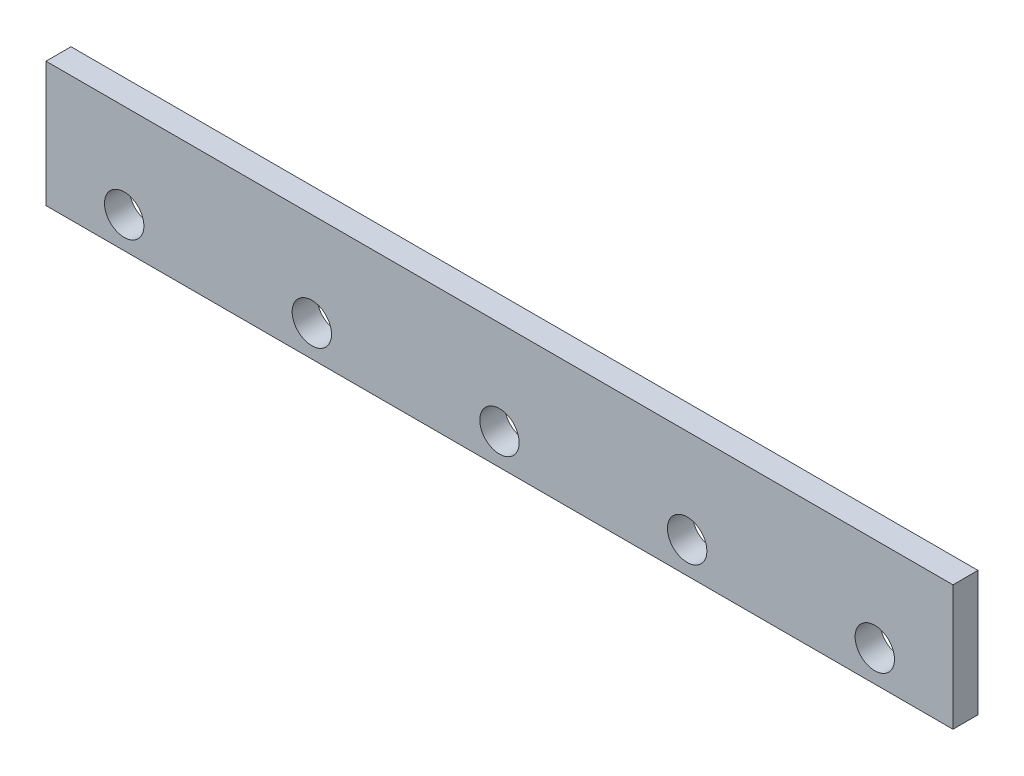
ISO-10303-21;
HEADER;
FILE_DESCRIPTION(('STEP AP214'),'2;1');
FILE_NAME('part.step','',(''),(''),'','','');
FILE_SCHEMA(('AUTOMOTIVE_DESIGN { 1 0 10303 214 1 1 1 1 }'));
ENDSEC;
DATA;
#1=APPLICATION_CONTEXT('core data for automotive mechanical design processes');
#2=APPLICATION_PROTOCOL_DEFINITION('international standard','automotive_design',2000,#1);
#3=PRODUCT_CONTEXT('',#1,'mechanical');
#4=PRODUCT('Part','Part','',(#3));
#5=PRODUCT_RELATED_PRODUCT_CATEGORY('part','',(#4));
#6=PRODUCT_DEFINITION_FORMATION('','',#4);
#7=PRODUCT_DEFINITION_CONTEXT('part definition',#1,'design');
#8=PRODUCT_DEFINITION('design','',#6,#7);
#9=PRODUCT_DEFINITION_SHAPE('','',#8);
#10=(LENGTH_UNIT() NAMED_UNIT(*) SI_UNIT(.MILLI.,.METRE.));
#11=(NAMED_UNIT(*) PLANE_ANGLE_UNIT() SI_UNIT($,.RADIAN.));
#12=(NAMED_UNIT(*) SI_UNIT($,.STERADIAN.) SOLID_ANGLE_UNIT());
#13=UNCERTAINTY_MEASURE_WITH_UNIT(LENGTH_MEASURE(1.E-05),#10,'distance_accuracy_value','');
#14=(GEOMETRIC_REPRESENTATION_CONTEXT(3) GLOBAL_UNCERTAINTY_ASSIGNED_CONTEXT((#13)) GLOBAL_UNIT_ASSIGNED_CONTEXT((#10,
#11,#12)) REPRESENTATION_CONTEXT('',''));
#15=CARTESIAN_POINT('',(0.,0.,0.));
#16=DIRECTION('',(0.,0.,1.));
#17=DIRECTION('',(1.,0.,0.));
#18=AXIS2_PLACEMENT_3D('',#15,#16,#17);
#19=CARTESIAN_POINT('',(0.,0.,16.));
#20=DIRECTION('',(0.,0.,-1.));
#21=DIRECTION('',(-1.,0.,0.));
#22=AXIS2_PLACEMENT_3D('',#19,#20,#21);
#23=PLANE('',#22);
#24=DIRECTION('',(0.,-1.,0.));
#25=VECTOR('',#24,1.);
#26=CARTESIAN_POINT('',(0.,0.,16.));
#27=LINE('',#26,#25);
#28=CARTESIAN_POINT('',(0.,80.,16.));
#29=VERTEX_POINT('',#28);
#30=CARTESIAN_POINT('',(0.,0.,16.));
#31=VERTEX_POINT('',#30);
#32=EDGE_CURVE('E85',#29,#31,#27,.T.);
#33=ORIENTED_EDGE('',*,*,#32,.T.);
#34=DIRECTION('',(1.,0.,0.));
#35=VECTOR('',#34,1.);
#36=CARTESIAN_POINT('',(0.,0.,16.));
#37=LINE('',#36,#35);
#38=CARTESIAN_POINT('',(580.,0.,16.));
#39=VERTEX_POINT('',#38);
#40=EDGE_CURVE('E80',#31,#39,#37,.T.);
#41=ORIENTED_EDGE('',*,*,#40,.T.);
#42=DIRECTION('',(0.,1.,0.));
#43=VECTOR('',#42,1.);
#44=CARTESIAN_POINT('',(580.,0.,16.));
#45=LINE('',#44,#43);
#46=CARTESIAN_POINT('',(580.,80.,16.));
#47=VERTEX_POINT('',#46);
#48=EDGE_CURVE('E83',#39,#47,#45,.T.);
#49=ORIENTED_EDGE('',*,*,#48,.T.);
#50=DIRECTION('',(-1.,0.,0.));
#51=VECTOR('',#50,1.);
#52=CARTESIAN_POINT('',(0.,80.,16.));
#53=LINE('',#52,#51);
#54=EDGE_CURVE('E50',#47,#29,#53,.T.);
#55=ORIENTED_EDGE('',*,*,#54,.T.);
#56=EDGE_LOOP('',(#33,#41,#49,#55));
#57=FACE_BOUND('',#56,.T.);
#58=CARTESIAN_POINT('',(50.,20.,16.));
#59=DIRECTION('',(0.,0.,1.));
#60=DIRECTION('',(1.,0.,0.));
#61=AXIS2_PLACEMENT_3D('',#58,#59,#60);
#62=CIRCLE('',#61,12.6);
#63=CARTESIAN_POINT('',(62.6,20.,16.));
#64=VERTEX_POINT('',#63);
#65=EDGE_CURVE('E100',#64,#64,#62,.T.);
#66=ORIENTED_EDGE('',*,*,#65,.F.);
#67=EDGE_LOOP('',(#66));
#68=FACE_BOUND('',#67,.T.);
#69=CARTESIAN_POINT('',(170.,20.,16.));
#70=DIRECTION('',(0.,0.,1.));
#71=DIRECTION('',(1.,0.,0.));
#72=AXIS2_PLACEMENT_3D('',#69,#70,#71);
#73=CIRCLE('',#72,12.6);
#74=CARTESIAN_POINT('',(182.6,20.,16.));
#75=VERTEX_POINT('',#74);
#76=EDGE_CURVE('E115',#75,#75,#73,.T.);
#77=ORIENTED_EDGE('',*,*,#76,.F.);
#78=EDGE_LOOP('',(#77));
#79=FACE_BOUND('',#78,.T.);
#80=CARTESIAN_POINT('',(290.,20.,16.));
#81=DIRECTION('',(0.,0.,1.));
#82=DIRECTION('',(1.,0.,0.));
#83=AXIS2_PLACEMENT_3D('',#80,#81,#82);
#84=CIRCLE('',#83,12.6);
#85=CARTESIAN_POINT('',(302.6,20.,16.));
#86=VERTEX_POINT('',#85);
#87=EDGE_CURVE('E121',#86,#86,#84,.T.);
#88=ORIENTED_EDGE('',*,*,#87,.F.);
#89=EDGE_LOOP('',(#88));
#90=FACE_BOUND('',#89,.T.);
#91=CARTESIAN_POINT('',(410.,20.,16.));
#92=DIRECTION('',(0.,0.,1.));
#93=DIRECTION('',(1.,0.,0.));
#94=AXIS2_PLACEMENT_3D('',#91,#92,#93);
#95=CIRCLE('',#94,12.6);
#96=CARTESIAN_POINT('',(422.6,20.,16.));
#97=VERTEX_POINT('',#96);
#98=EDGE_CURVE('E127',#97,#97,#95,.T.);
#99=ORIENTED_EDGE('',*,*,#98,.F.);
#100=EDGE_LOOP('',(#99));
#101=FACE_BOUND('',#100,.T.);
#102=CARTESIAN_POINT('',(530.,20.,16.));
#103=DIRECTION('',(0.,0.,1.));
#104=DIRECTION('',(1.,0.,0.));
#105=AXIS2_PLACEMENT_3D('',#102,#103,#104);
#106=CIRCLE('',#105,12.5999999999999);
#107=CARTESIAN_POINT('',(542.6,20.,16.));
#108=VERTEX_POINT('',#107);
#109=EDGE_CURVE('E133',#108,#108,#106,.T.);
#110=ORIENTED_EDGE('',*,*,#109,.F.);
#111=EDGE_LOOP('',(#110));
#112=FACE_BOUND('',#111,.T.);
#113=ADVANCED_FACE('F33',(#57,#68,#79,#90,#101,#112),#23,.F.);
#114=CARTESIAN_POINT('',(0.,0.,0.));
#115=DIRECTION('',(0.,0.,-1.));
#116=DIRECTION('',(-1.,0.,0.));
#117=AXIS2_PLACEMENT_3D('',#114,#115,#116);
#118=PLANE('',#117);
#119=CARTESIAN_POINT('',(410.,20.,0.));
#120=DIRECTION('',(0.,0.,1.));
#121=DIRECTION('',(1.,0.,0.));
#122=AXIS2_PLACEMENT_3D('',#119,#120,#121);
#123=CIRCLE('',#122,12.6);
#124=CARTESIAN_POINT('',(422.6,20.,0.));
#125=VERTEX_POINT('',#124);
#126=EDGE_CURVE('E130',#125,#125,#123,.T.);
#127=ORIENTED_EDGE('',*,*,#126,.T.);
#128=EDGE_LOOP('',(#127));
#129=FACE_BOUND('',#128,.T.);
#130=CARTESIAN_POINT('',(170.,20.,0.));
#131=DIRECTION('',(0.,0.,1.));
#132=DIRECTION('',(1.,0.,0.));
#133=AXIS2_PLACEMENT_3D('',#130,#131,#132);
#134=CIRCLE('',#133,12.6);
#135=CARTESIAN_POINT('',(182.6,20.,0.));
#136=VERTEX_POINT('',#135);
#137=EDGE_CURVE('E118',#136,#136,#134,.T.);
#138=ORIENTED_EDGE('',*,*,#137,.T.);
#139=EDGE_LOOP('',(#138));
#140=FACE_BOUND('',#139,.T.);
#141=DIRECTION('',(0.,-1.,0.));
#142=VECTOR('',#141,1.);
#143=CARTESIAN_POINT('',(0.,0.,0.));
#144=LINE('',#143,#142);
#145=CARTESIAN_POINT('',(0.,80.,0.));
#146=VERTEX_POINT('',#145);
#147=CARTESIAN_POINT('',(0.,0.,0.));
#148=VERTEX_POINT('',#147);
#149=EDGE_CURVE('E97',#146,#148,#144,.T.);
#150=ORIENTED_EDGE('',*,*,#149,.F.);
#151=DIRECTION('',(-1.,0.,0.));
#152=VECTOR('',#151,1.);
#153=CARTESIAN_POINT('',(0.,80.,0.));
#154=LINE('',#153,#152);
#155=CARTESIAN_POINT('',(580.,80.,0.));
#156=VERTEX_POINT('',#155);
#157=EDGE_CURVE('E73',#156,#146,#154,.T.);
#158=ORIENTED_EDGE('',*,*,#157,.F.);
#159=DIRECTION('',(0.,1.,0.));
#160=VECTOR('',#159,1.);
#161=CARTESIAN_POINT('',(580.,0.,0.));
#162=LINE('',#161,#160);
#163=CARTESIAN_POINT('',(580.,0.,0.));
#164=VERTEX_POINT('',#163);
#165=EDGE_CURVE('E67',#164,#156,#162,.T.);
#166=ORIENTED_EDGE('',*,*,#165,.F.);
#167=DIRECTION('',(1.,0.,0.));
#168=VECTOR('',#167,1.);
#169=CARTESIAN_POINT('',(0.,0.,0.));
#170=LINE('',#169,#168);
#171=EDGE_CURVE('E89',#148,#164,#170,.T.);
#172=ORIENTED_EDGE('',*,*,#171,.F.);
#173=EDGE_LOOP('',(#150,#158,#166,#172));
#174=FACE_BOUND('',#173,.T.);
#175=CARTESIAN_POINT('',(50.,20.,0.));
#176=DIRECTION('',(0.,0.,1.));
#177=DIRECTION('',(1.,0.,0.));
#178=AXIS2_PLACEMENT_3D('',#175,#176,#177);
#179=CIRCLE('',#178,12.6);
#180=CARTESIAN_POINT('',(62.6,20.,0.));
#181=VERTEX_POINT('',#180);
#182=EDGE_CURVE('E112',#181,#181,#179,.T.);
#183=ORIENTED_EDGE('',*,*,#182,.T.);
#184=EDGE_LOOP('',(#183));
#185=FACE_BOUND('',#184,.T.);
#186=CARTESIAN_POINT('',(290.,20.,0.));
#187=DIRECTION('',(0.,0.,1.));
#188=DIRECTION('',(1.,0.,0.));
#189=AXIS2_PLACEMENT_3D('',#186,#187,#188);
#190=CIRCLE('',#189,12.6);
#191=CARTESIAN_POINT('',(302.6,20.,0.));
#192=VERTEX_POINT('',#191);
#193=EDGE_CURVE('E124',#192,#192,#190,.T.);
#194=ORIENTED_EDGE('',*,*,#193,.T.);
#195=EDGE_LOOP('',(#194));
#196=FACE_BOUND('',#195,.T.);
#197=CARTESIAN_POINT('',(530.,20.,0.));
#198=DIRECTION('',(0.,0.,1.));
#199=DIRECTION('',(1.,0.,0.));
#200=AXIS2_PLACEMENT_3D('',#197,#198,#199);
#201=CIRCLE('',#200,12.5999999999999);
#202=CARTESIAN_POINT('',(542.6,20.,0.));
#203=VERTEX_POINT('',#202);
#204=EDGE_CURVE('E136',#203,#203,#201,.T.);
#205=ORIENTED_EDGE('',*,*,#204,.T.);
#206=EDGE_LOOP('',(#205));
#207=FACE_BOUND('',#206,.T.);
#208=ADVANCED_FACE('F108',(#129,#140,#174,#185,#196,#207),#118,.T.);
#209=CARTESIAN_POINT('',(0.,0.,16.));
#210=DIRECTION('',(1.,0.,0.));
#211=DIRECTION('',(0.,0.,-1.));
#212=AXIS2_PLACEMENT_3D('',#209,#210,#211);
#213=PLANE('',#212);
#214=ORIENTED_EDGE('',*,*,#149,.T.);
#215=DIRECTION('',(0.,0.,-1.));
#216=VECTOR('',#215,1.);
#217=CARTESIAN_POINT('',(0.,0.,16.));
#218=LINE('',#217,#216);
#219=EDGE_CURVE('E11',#31,#148,#218,.T.);
#220=ORIENTED_EDGE('',*,*,#219,.F.);
#221=ORIENTED_EDGE('',*,*,#32,.F.);
#222=DIRECTION('',(0.,0.,-1.));
#223=VECTOR('',#222,1.);
#224=CARTESIAN_POINT('',(0.,80.,16.));
#225=LINE('',#224,#223);
#226=EDGE_CURVE('E93',#29,#146,#225,.T.);
#227=ORIENTED_EDGE('',*,*,#226,.T.);
#228=EDGE_LOOP('',(#214,#220,#221,#227));
#229=FACE_BOUND('',#228,.T.);
#230=ADVANCED_FACE('F35',(#229),#213,.F.);
#231=CARTESIAN_POINT('',(0.,0.,16.));
#232=DIRECTION('',(0.,1.,0.));
#233=DIRECTION('',(0.,0.,1.));
#234=AXIS2_PLACEMENT_3D('',#231,#232,#233);
#235=PLANE('',#234);
#236=ORIENTED_EDGE('',*,*,#171,.T.);
#237=DIRECTION('',(0.,0.,-1.));
#238=VECTOR('',#237,1.);
#239=CARTESIAN_POINT('',(580.,0.,16.));
#240=LINE('',#239,#238);
#241=EDGE_CURVE('E42',#39,#164,#240,.T.);
#242=ORIENTED_EDGE('',*,*,#241,.F.);
#243=ORIENTED_EDGE('',*,*,#40,.F.);
#244=ORIENTED_EDGE('',*,*,#219,.T.);
#245=EDGE_LOOP('',(#236,#242,#243,#244));
#246=FACE_BOUND('',#245,.T.);
#247=ADVANCED_FACE('F88',(#246),#235,.F.);
#248=CARTESIAN_POINT('',(580.,0.,16.));
#249=DIRECTION('',(-1.,0.,0.));
#250=DIRECTION('',(0.,0.,1.));
#251=AXIS2_PLACEMENT_3D('',#248,#249,#250);
#252=PLANE('',#251);
#253=ORIENTED_EDGE('',*,*,#165,.T.);
#254=DIRECTION('',(0.,0.,-1.));
#255=VECTOR('',#254,1.);
#256=CARTESIAN_POINT('',(580.,80.,16.));
#257=LINE('',#256,#255);
#258=EDGE_CURVE('E90',#47,#156,#257,.T.);
#259=ORIENTED_EDGE('',*,*,#258,.F.);
#260=ORIENTED_EDGE('',*,*,#48,.F.);
#261=ORIENTED_EDGE('',*,*,#241,.T.);
#262=EDGE_LOOP('',(#253,#259,#260,#261));
#263=FACE_BOUND('',#262,.T.);
#264=ADVANCED_FACE('F91',(#263),#252,.F.);
#265=CARTESIAN_POINT('',(0.,80.,16.));
#266=DIRECTION('',(0.,-1.,0.));
#267=DIRECTION('',(0.,0.,-1.));
#268=AXIS2_PLACEMENT_3D('',#265,#266,#267);
#269=PLANE('',#268);
#270=ORIENTED_EDGE('',*,*,#157,.T.);
#271=ORIENTED_EDGE('',*,*,#226,.F.);
#272=ORIENTED_EDGE('',*,*,#54,.F.);
#273=ORIENTED_EDGE('',*,*,#258,.T.);
#274=EDGE_LOOP('',(#270,#271,#272,#273));
#275=FACE_BOUND('',#274,.T.);
#276=ADVANCED_FACE('F105',(#275),#269,.F.);
#277=CARTESIAN_POINT('',(50.,20.,16.));
#278=DIRECTION('',(0.,0.,-1.));
#279=DIRECTION('',(-1.,0.,0.));
#280=AXIS2_PLACEMENT_3D('',#277,#278,#279);
#281=CYLINDRICAL_SURFACE('',#280,12.6);
#282=ORIENTED_EDGE('',*,*,#65,.T.);
#283=EDGE_LOOP('',(#282));
#284=FACE_BOUND('',#283,.T.);
#285=ORIENTED_EDGE('',*,*,#182,.F.);
#286=EDGE_LOOP('',(#285));
#287=FACE_BOUND('',#286,.T.);
#288=ADVANCED_FACE('F153',(#284,#287),#281,.F.);
#289=CARTESIAN_POINT('',(170.,20.,16.));
#290=DIRECTION('',(0.,0.,-1.));
#291=DIRECTION('',(-1.,0.,0.));
#292=AXIS2_PLACEMENT_3D('',#289,#290,#291);
#293=CYLINDRICAL_SURFACE('',#292,12.6);
#294=ORIENTED_EDGE('',*,*,#76,.T.);
#295=EDGE_LOOP('',(#294));
#296=FACE_BOUND('',#295,.T.);
#297=ORIENTED_EDGE('',*,*,#137,.F.);
#298=EDGE_LOOP('',(#297));
#299=FACE_BOUND('',#298,.T.);
#300=ADVANCED_FACE('F199',(#296,#299),#293,.F.);
#301=CARTESIAN_POINT('',(290.,20.,16.));
#302=DIRECTION('',(0.,0.,-1.));
#303=DIRECTION('',(-1.,0.,0.));
#304=AXIS2_PLACEMENT_3D('',#301,#302,#303);
#305=CYLINDRICAL_SURFACE('',#304,12.6);
#306=ORIENTED_EDGE('',*,*,#87,.T.);
#307=EDGE_LOOP('',(#306));
#308=FACE_BOUND('',#307,.T.);
#309=ORIENTED_EDGE('',*,*,#193,.F.);
#310=EDGE_LOOP('',(#309));
#311=FACE_BOUND('',#310,.T.);
#312=ADVANCED_FACE('F207',(#308,#311),#305,.F.);
#313=CARTESIAN_POINT('',(410.,20.,16.));
#314=DIRECTION('',(0.,0.,-1.));
#315=DIRECTION('',(-1.,0.,0.));
#316=AXIS2_PLACEMENT_3D('',#313,#314,#315);
#317=CYLINDRICAL_SURFACE('',#316,12.6);
#318=ORIENTED_EDGE('',*,*,#98,.T.);
#319=EDGE_LOOP('',(#318));
#320=FACE_BOUND('',#319,.T.);
#321=ORIENTED_EDGE('',*,*,#126,.F.);
#322=EDGE_LOOP('',(#321));
#323=FACE_BOUND('',#322,.T.);
#324=ADVANCED_FACE('F215',(#320,#323),#317,.F.);
#325=CARTESIAN_POINT('',(530.,20.,16.));
#326=DIRECTION('',(0.,0.,-1.));
#327=DIRECTION('',(-1.,0.,0.));
#328=AXIS2_PLACEMENT_3D('',#325,#326,#327);
#329=CYLINDRICAL_SURFACE('',#328,12.5999999999999);
#330=ORIENTED_EDGE('',*,*,#109,.T.);
#331=EDGE_LOOP('',(#330));
#332=FACE_BOUND('',#331,.T.);
#333=ORIENTED_EDGE('',*,*,#204,.F.);
#334=EDGE_LOOP('',(#333));
#335=FACE_BOUND('',#334,.T.);
#336=ADVANCED_FACE('F142',(#332,#335),#329,.F.);
#337=CLOSED_SHELL('',(#113,#208,#230,#247,#264,#276,#288,#300,#312,#324,#336));
#338=MANIFOLD_SOLID_BREP('B2',#337);
#339=ADVANCED_BREP_SHAPE_REPRESENTATION('',(#18,#338),#14);
#340=SHAPE_DEFINITION_REPRESENTATION(#9,#339);
ENDSEC;
END-ISO-10303-21;
